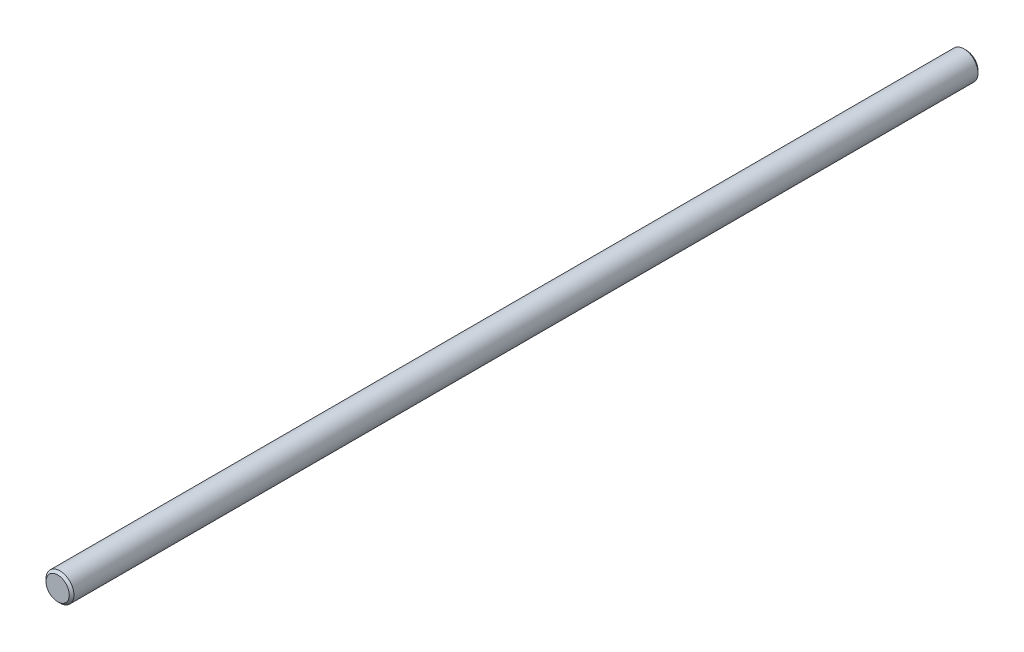
ISO-10303-21;
HEADER;
FILE_DESCRIPTION(('STEP AP214'),'2;1');
FILE_NAME('part.step','',(''),(''),'','','');
FILE_SCHEMA(('AUTOMOTIVE_DESIGN { 1 0 10303 214 1 1 1 1 }'));
ENDSEC;
DATA;
#1=APPLICATION_CONTEXT('core data for automotive mechanical design processes');
#2=APPLICATION_PROTOCOL_DEFINITION('international standard','automotive_design',2000,#1);
#3=PRODUCT_CONTEXT('',#1,'mechanical');
#4=PRODUCT('Part','Part','',(#3));
#5=PRODUCT_RELATED_PRODUCT_CATEGORY('part','',(#4));
#6=PRODUCT_DEFINITION_FORMATION('','',#4);
#7=PRODUCT_DEFINITION_CONTEXT('part definition',#1,'design');
#8=PRODUCT_DEFINITION('design','',#6,#7);
#9=PRODUCT_DEFINITION_SHAPE('','',#8);
#10=(LENGTH_UNIT() NAMED_UNIT(*) SI_UNIT(.MILLI.,.METRE.));
#11=(NAMED_UNIT(*) PLANE_ANGLE_UNIT() SI_UNIT($,.RADIAN.));
#12=(NAMED_UNIT(*) SI_UNIT($,.STERADIAN.) SOLID_ANGLE_UNIT());
#13=UNCERTAINTY_MEASURE_WITH_UNIT(LENGTH_MEASURE(1.E-05),#10,'distance_accuracy_value','');
#14=(GEOMETRIC_REPRESENTATION_CONTEXT(3) GLOBAL_UNCERTAINTY_ASSIGNED_CONTEXT((#13)) GLOBAL_UNIT_ASSIGNED_CONTEXT((#10,
#11,#12)) REPRESENTATION_CONTEXT('',''));
#15=CARTESIAN_POINT('',(0.,0.,0.));
#16=DIRECTION('',(0.,0.,1.));
#17=DIRECTION('',(1.,0.,0.));
#18=AXIS2_PLACEMENT_3D('',#15,#16,#17);
#19=CARTESIAN_POINT('',(0.,0.,390.));
#20=DIRECTION('',(0.,0.,-1.));
#21=DIRECTION('',(-1.,0.,0.));
#22=AXIS2_PLACEMENT_3D('',#19,#20,#21);
#23=CYLINDRICAL_SURFACE('',#22,6.);
#24=CARTESIAN_POINT('',(0.,0.,389.));
#25=DIRECTION('',(0.,0.,1.));
#26=DIRECTION('',(1.,0.,0.));
#27=AXIS2_PLACEMENT_3D('',#24,#25,#26);
#28=CIRCLE('',#27,6.);
#29=CARTESIAN_POINT('',(6.,0.,389.));
#30=VERTEX_POINT('',#29);
#31=EDGE_CURVE('E37',#30,#30,#28,.F.);
#32=ORIENTED_EDGE('',*,*,#31,.T.);
#33=EDGE_LOOP('',(#32));
#34=FACE_BOUND('',#33,.T.);
#35=CARTESIAN_POINT('',(0.,0.,0.999999999999945));
#36=DIRECTION('',(0.,0.,1.));
#37=DIRECTION('',(1.,0.,0.));
#38=AXIS2_PLACEMENT_3D('',#35,#36,#37);
#39=CIRCLE('',#38,6.);
#40=CARTESIAN_POINT('',(6.,0.,0.999999999999945));
#41=VERTEX_POINT('',#40);
#42=EDGE_CURVE('E41',#41,#41,#39,.T.);
#43=ORIENTED_EDGE('',*,*,#42,.T.);
#44=EDGE_LOOP('',(#43));
#45=FACE_BOUND('',#44,.T.);
#46=ADVANCED_FACE('F30',(#34,#45),#23,.T.);
#47=CARTESIAN_POINT('',(0.,0.,390.));
#48=DIRECTION('',(0.,0.,1.));
#49=DIRECTION('',(1.,0.,0.));
#50=AXIS2_PLACEMENT_3D('',#47,#48,#49);
#51=PLANE('',#50);
#52=CARTESIAN_POINT('',(0.,0.,390.));
#53=DIRECTION('',(0.,0.,1.));
#54=DIRECTION('',(1.,0.,0.));
#55=AXIS2_PLACEMENT_3D('',#52,#53,#54);
#56=CIRCLE('',#55,5.);
#57=CARTESIAN_POINT('',(5.,0.,390.));
#58=VERTEX_POINT('',#57);
#59=EDGE_CURVE('E45',#58,#58,#56,.T.);
#60=ORIENTED_EDGE('',*,*,#59,.T.);
#61=EDGE_LOOP('',(#60));
#62=FACE_BOUND('',#61,.T.);
#63=ADVANCED_FACE('F51',(#62),#51,.T.);
#64=CARTESIAN_POINT('',(0.,0.,0.));
#65=DIRECTION('',(0.,0.,1.));
#66=DIRECTION('',(1.,0.,0.));
#67=AXIS2_PLACEMENT_3D('',#64,#65,#66);
#68=PLANE('',#67);
#69=CARTESIAN_POINT('',(0.,0.,0.));
#70=DIRECTION('',(0.,0.,1.));
#71=DIRECTION('',(1.,0.,0.));
#72=AXIS2_PLACEMENT_3D('',#69,#70,#71);
#73=CIRCLE('',#72,5.00000000000006);
#74=CARTESIAN_POINT('',(5.00000000000006,0.,0.));
#75=VERTEX_POINT('',#74);
#76=EDGE_CURVE('E10',#75,#75,#73,.F.);
#77=ORIENTED_EDGE('',*,*,#76,.T.);
#78=EDGE_LOOP('',(#77));
#79=FACE_BOUND('',#78,.T.);
#80=ADVANCED_FACE('F55',(#79),#68,.F.);
#81=CARTESIAN_POINT('',(0.,0.,390.));
#82=DIRECTION('',(0.,0.,-1.));
#83=DIRECTION('',(-1.,0.,0.));
#84=AXIS2_PLACEMENT_3D('',#81,#82,#83);
#85=CONICAL_SURFACE('',#84,5.,0.785398163397446);
#86=ORIENTED_EDGE('',*,*,#31,.F.);
#87=EDGE_LOOP('',(#86));
#88=FACE_BOUND('',#87,.T.);
#89=ORIENTED_EDGE('',*,*,#59,.F.);
#90=EDGE_LOOP('',(#89));
#91=FACE_BOUND('',#90,.T.);
#92=ADVANCED_FACE('F53',(#88,#91),#85,.T.);
#93=CARTESIAN_POINT('',(0.,0.,0.999999999999945));
#94=DIRECTION('',(0.,0.,1.));
#95=DIRECTION('',(1.,0.,0.));
#96=AXIS2_PLACEMENT_3D('',#93,#94,#95);
#97=CONICAL_SURFACE('',#96,6.,0.785398163397446);
#98=ORIENTED_EDGE('',*,*,#76,.F.);
#99=EDGE_LOOP('',(#98));
#100=FACE_BOUND('',#99,.T.);
#101=ORIENTED_EDGE('',*,*,#42,.F.);
#102=EDGE_LOOP('',(#101));
#103=FACE_BOUND('',#102,.T.);
#104=ADVANCED_FACE('F32',(#100,#103),#97,.T.);
#105=CLOSED_SHELL('',(#46,#63,#80,#92,#104));
#106=MANIFOLD_SOLID_BREP('B2',#105);
#107=ADVANCED_BREP_SHAPE_REPRESENTATION('',(#18,#106),#14);
#108=SHAPE_DEFINITION_REPRESENTATION(#9,#107);
ENDSEC;
END-ISO-10303-21;
